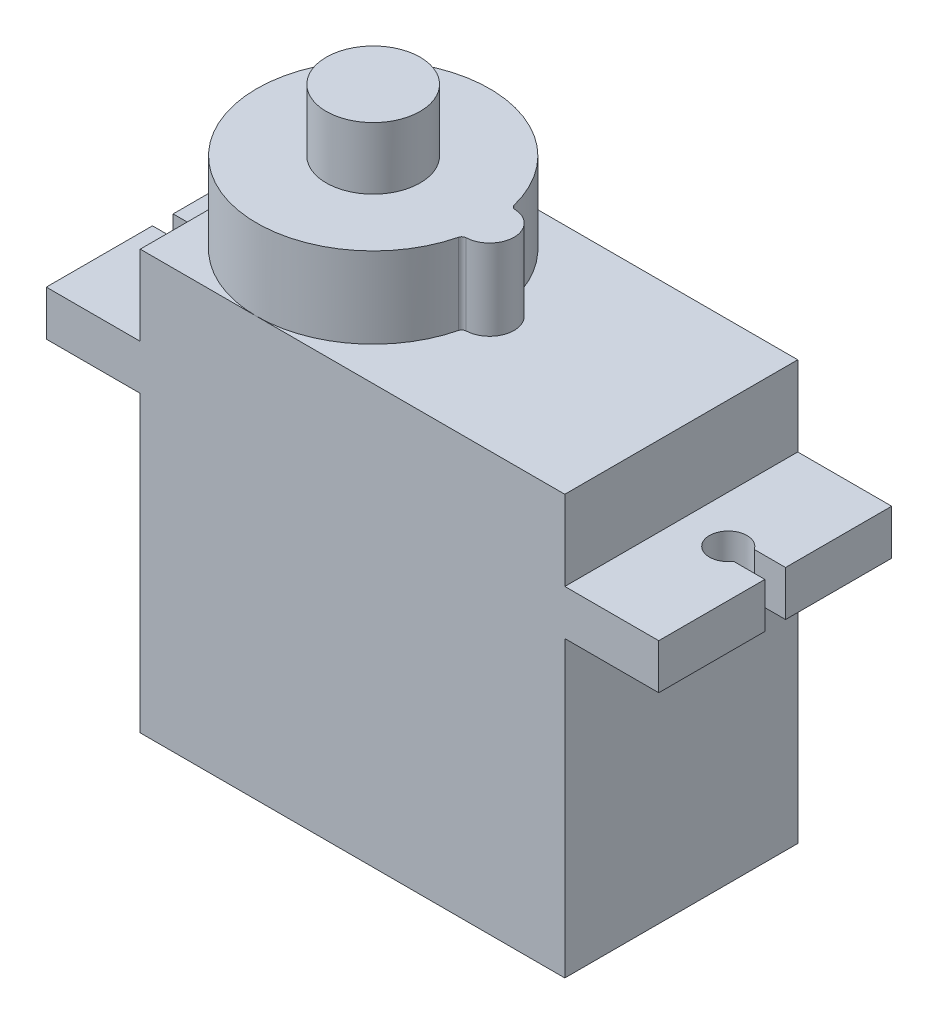
ISO-10303-21;
HEADER;
FILE_DESCRIPTION(('STEP AP214'),'2;1');
FILE_NAME('part.step','',(''),(''),'','','');
FILE_SCHEMA(('AUTOMOTIVE_DESIGN { 1 0 10303 214 1 1 1 1 }'));
ENDSEC;
DATA;
#1=APPLICATION_CONTEXT('core data for automotive mechanical design processes');
#2=APPLICATION_PROTOCOL_DEFINITION('international standard','automotive_design',2000,#1);
#3=PRODUCT_CONTEXT('',#1,'mechanical');
#4=PRODUCT('Part','Part','',(#3));
#5=PRODUCT_RELATED_PRODUCT_CATEGORY('part','',(#4));
#6=PRODUCT_DEFINITION_FORMATION('','',#4);
#7=PRODUCT_DEFINITION_CONTEXT('part definition',#1,'design');
#8=PRODUCT_DEFINITION('design','',#6,#7);
#9=PRODUCT_DEFINITION_SHAPE('','',#8);
#10=(LENGTH_UNIT() NAMED_UNIT(*) SI_UNIT(.MILLI.,.METRE.));
#11=(NAMED_UNIT(*) PLANE_ANGLE_UNIT() SI_UNIT($,.RADIAN.));
#12=(NAMED_UNIT(*) SI_UNIT($,.STERADIAN.) SOLID_ANGLE_UNIT());
#13=UNCERTAINTY_MEASURE_WITH_UNIT(LENGTH_MEASURE(1.E-05),#10,'distance_accuracy_value','');
#14=(GEOMETRIC_REPRESENTATION_CONTEXT(3) GLOBAL_UNCERTAINTY_ASSIGNED_CONTEXT((#13)) GLOBAL_UNIT_ASSIGNED_CONTEXT((#10,
#11,#12)) REPRESENTATION_CONTEXT('',''));
#15=CARTESIAN_POINT('',(0.,0.,0.));
#16=DIRECTION('',(0.,0.,1.));
#17=DIRECTION('',(1.,0.,0.));
#18=AXIS2_PLACEMENT_3D('',#15,#16,#17);
#19=CARTESIAN_POINT('',(-14.6,4.5,1.2));
#20=DIRECTION('',(1.,0.,0.));
#21=DIRECTION('',(0.,0.,-1.));
#22=AXIS2_PLACEMENT_3D('',#19,#20,#21);
#23=CYLINDRICAL_SURFACE('',#22,0.6);
#24=CARTESIAN_POINT('',(-14.6,4.5,1.2));
#25=DIRECTION('',(-1.,0.,0.));
#26=DIRECTION('',(0.,0.,1.));
#27=AXIS2_PLACEMENT_3D('',#24,#25,#26);
#28=CIRCLE('',#27,0.6);
#29=CARTESIAN_POINT('',(-14.6,4.5,1.8));
#30=VERTEX_POINT('',#29);
#31=EDGE_CURVE('E11',#30,#30,#28,.T.);
#32=ORIENTED_EDGE('',*,*,#31,.F.);
#33=EDGE_LOOP('',(#32));
#34=FACE_BOUND('',#33,.T.);
#35=CARTESIAN_POINT('',(-11.3,4.5,1.2));
#36=DIRECTION('',(-1.,0.,0.));
#37=DIRECTION('',(0.,0.,1.));
#38=AXIS2_PLACEMENT_3D('',#35,#36,#37);
#39=CIRCLE('',#38,0.6);
#40=CARTESIAN_POINT('',(-11.3,4.5,1.8));
#41=VERTEX_POINT('',#40);
#42=EDGE_CURVE('E55',#41,#41,#39,.T.);
#43=ORIENTED_EDGE('',*,*,#42,.T.);
#44=EDGE_LOOP('',(#43));
#45=FACE_BOUND('',#44,.T.);
#46=ADVANCED_FACE('F52',(#34,#45),#23,.T.);
#47=CARTESIAN_POINT('',(-14.6,0.,0.));
#48=DIRECTION('',(-1.,0.,0.));
#49=DIRECTION('',(0.,0.,1.));
#50=AXIS2_PLACEMENT_3D('',#47,#48,#49);
#51=PLANE('',#50);
#52=ORIENTED_EDGE('',*,*,#31,.T.);
#53=EDGE_LOOP('',(#52));
#54=FACE_BOUND('',#53,.T.);
#55=ADVANCED_FACE('F67',(#54),#51,.T.);
#56=CARTESIAN_POINT('',(-11.3,0.,0.));
#57=DIRECTION('',(-1.,0.,0.));
#58=DIRECTION('',(0.,0.,1.));
#59=AXIS2_PLACEMENT_3D('',#56,#57,#58);
#60=PLANE('',#59);
#61=ORIENTED_EDGE('',*,*,#42,.F.);
#62=EDGE_LOOP('',(#61));
#63=FACE_BOUND('',#62,.T.);
#64=ADVANCED_FACE('F65',(#63),#60,.F.);
#65=CLOSED_SHELL('',(#46,#55,#64));
#66=MANIFOLD_SOLID_BREP('B2',#65);
#67=CARTESIAN_POINT('',(-14.6,4.5,0.));
#68=DIRECTION('',(1.,0.,0.));
#69=DIRECTION('',(0.,0.,-1.));
#70=AXIS2_PLACEMENT_3D('',#67,#68,#69);
#71=CYLINDRICAL_SURFACE('',#70,0.6);
#72=CARTESIAN_POINT('',(-14.6,4.5,0.));
#73=DIRECTION('',(-1.,0.,0.));
#74=DIRECTION('',(0.,0.,1.));
#75=AXIS2_PLACEMENT_3D('',#72,#73,#74);
#76=CIRCLE('',#75,0.6);
#77=CARTESIAN_POINT('',(-14.6,4.5,0.600000000000002));
#78=VERTEX_POINT('',#77);
#79=EDGE_CURVE('E51',#78,#78,#76,.T.);
#80=ORIENTED_EDGE('',*,*,#79,.F.);
#81=EDGE_LOOP('',(#80));
#82=FACE_BOUND('',#81,.T.);
#83=CARTESIAN_POINT('',(-11.3,4.5,0.));
#84=DIRECTION('',(-1.,0.,0.));
#85=DIRECTION('',(0.,0.,1.));
#86=AXIS2_PLACEMENT_3D('',#83,#84,#85);
#87=CIRCLE('',#86,0.6);
#88=CARTESIAN_POINT('',(-11.3,4.5,0.600000000000001));
#89=VERTEX_POINT('',#88);
#90=EDGE_CURVE('E98',#89,#89,#87,.T.);
#91=ORIENTED_EDGE('',*,*,#90,.T.);
#92=EDGE_LOOP('',(#91));
#93=FACE_BOUND('',#92,.T.);
#94=ADVANCED_FACE('F95',(#82,#93),#71,.T.);
#95=CARTESIAN_POINT('',(-14.6,0.,0.));
#96=DIRECTION('',(-1.,0.,0.));
#97=DIRECTION('',(0.,0.,1.));
#98=AXIS2_PLACEMENT_3D('',#95,#96,#97);
#99=PLANE('',#98);
#100=ORIENTED_EDGE('',*,*,#79,.T.);
#101=EDGE_LOOP('',(#100));
#102=FACE_BOUND('',#101,.T.);
#103=ADVANCED_FACE('F110',(#102),#99,.T.);
#104=CARTESIAN_POINT('',(-11.3,0.,0.));
#105=DIRECTION('',(-1.,0.,0.));
#106=DIRECTION('',(0.,0.,1.));
#107=AXIS2_PLACEMENT_3D('',#104,#105,#106);
#108=PLANE('',#107);
#109=ORIENTED_EDGE('',*,*,#90,.F.);
#110=EDGE_LOOP('',(#109));
#111=FACE_BOUND('',#110,.T.);
#112=ADVANCED_FACE('F108',(#111),#108,.F.);
#113=CLOSED_SHELL('',(#94,#103,#112));
#114=MANIFOLD_SOLID_BREP('B6',#113);
#115=CARTESIAN_POINT('',(-14.6,4.5,-1.2));
#116=DIRECTION('',(1.,0.,0.));
#117=DIRECTION('',(0.,0.,-1.));
#118=AXIS2_PLACEMENT_3D('',#115,#116,#117);
#119=CYLINDRICAL_SURFACE('',#118,0.6);
#120=CARTESIAN_POINT('',(-14.6,4.5,-1.2));
#121=DIRECTION('',(-1.,0.,0.));
#122=DIRECTION('',(0.,0.,1.));
#123=AXIS2_PLACEMENT_3D('',#120,#121,#122);
#124=CIRCLE('',#123,0.6);
#125=CARTESIAN_POINT('',(-14.6,4.5,-0.599999999999998));
#126=VERTEX_POINT('',#125);
#127=EDGE_CURVE('E94',#126,#126,#124,.T.);
#128=ORIENTED_EDGE('',*,*,#127,.F.);
#129=EDGE_LOOP('',(#128));
#130=FACE_BOUND('',#129,.T.);
#131=CARTESIAN_POINT('',(-11.3,4.5,-1.2));
#132=DIRECTION('',(-1.,0.,0.));
#133=DIRECTION('',(0.,0.,1.));
#134=AXIS2_PLACEMENT_3D('',#131,#132,#133);
#135=CIRCLE('',#134,0.6);
#136=CARTESIAN_POINT('',(-11.3,4.5,-0.599999999999998));
#137=VERTEX_POINT('',#136);
#138=EDGE_CURVE('E172',#137,#137,#135,.T.);
#139=ORIENTED_EDGE('',*,*,#138,.T.);
#140=EDGE_LOOP('',(#139));
#141=FACE_BOUND('',#140,.T.);
#142=ADVANCED_FACE('F169',(#130,#141),#119,.T.);
#143=CARTESIAN_POINT('',(-14.6,0.,0.));
#144=DIRECTION('',(-1.,0.,0.));
#145=DIRECTION('',(0.,0.,1.));
#146=AXIS2_PLACEMENT_3D('',#143,#144,#145);
#147=PLANE('',#146);
#148=ORIENTED_EDGE('',*,*,#127,.T.);
#149=EDGE_LOOP('',(#148));
#150=FACE_BOUND('',#149,.T.);
#151=ADVANCED_FACE('F184',(#150),#147,.T.);
#152=CARTESIAN_POINT('',(-11.3,0.,0.));
#153=DIRECTION('',(-1.,0.,0.));
#154=DIRECTION('',(0.,0.,1.));
#155=AXIS2_PLACEMENT_3D('',#152,#153,#154);
#156=PLANE('',#155);
#157=ORIENTED_EDGE('',*,*,#138,.F.);
#158=EDGE_LOOP('',(#157));
#159=FACE_BOUND('',#158,.T.);
#160=ADVANCED_FACE('F182',(#159),#156,.F.);
#161=CLOSED_SHELL('',(#142,#151,#160));
#162=MANIFOLD_SOLID_BREP('B46',#161);
#163=CARTESIAN_POINT('',(0.,22.3,0.));
#164=DIRECTION('',(0.,-1.,0.));
#165=DIRECTION('',(0.,0.,-1.));
#166=AXIS2_PLACEMENT_3D('',#163,#164,#165);
#167=PLANE('',#166);
#168=CARTESIAN_POINT('',(1.16129032258064,22.3,-1.54878775058365));
#169=DIRECTION('',(0.,-1.,0.));
#170=DIRECTION('',(0.,0.,-1.));
#171=AXIS2_PLACEMENT_3D('',#168,#169,#170);
#172=CIRCLE('',#171,0.25);
#173=CARTESIAN_POINT('',(1.15140478668054,22.3,-1.29898327468306));
#174=VERTEX_POINT('',#173);
#175=CARTESIAN_POINT('',(0.918604651162789,22.3,-1.48875721761529));
#176=VERTEX_POINT('',#175);
#177=EDGE_CURVE('E249',#174,#176,#172,.T.);
#178=ORIENTED_EDGE('',*,*,#177,.F.);
#179=CARTESIAN_POINT('',(1.1,22.3,0.));
#180=DIRECTION('',(0.,1.,0.));
#181=DIRECTION('',(0.,0.,1.));
#182=AXIS2_PLACEMENT_3D('',#179,#180,#181);
#183=CIRCLE('',#182,1.3);
#184=CARTESIAN_POINT('',(1.15140478668054,22.3,1.29898327468306));
#185=VERTEX_POINT('',#184);
#186=EDGE_CURVE('E253',#185,#174,#183,.T.);
#187=ORIENTED_EDGE('',*,*,#186,.F.);
#188=CARTESIAN_POINT('',(1.16129032258064,22.3,1.54878775058365));
#189=DIRECTION('',(0.,-1.,0.));
#190=DIRECTION('',(0.,0.,1.));
#191=AXIS2_PLACEMENT_3D('',#188,#189,#190);
#192=CIRCLE('',#191,0.25);
#193=CARTESIAN_POINT('',(0.918604651162788,22.3,1.48875721761529));
#194=VERTEX_POINT('',#193);
#195=EDGE_CURVE('E589',#194,#185,#192,.T.);
#196=ORIENTED_EDGE('',*,*,#195,.F.);
#197=CARTESIAN_POINT('',(-5.1,22.3,0.));
#198=DIRECTION('',(0.,1.,0.));
#199=DIRECTION('',(0.,0.,1.));
#200=AXIS2_PLACEMENT_3D('',#197,#198,#199);
#201=CIRCLE('',#200,6.2);
#202=CARTESIAN_POINT('',(-5.1,22.3,6.2));
#203=VERTEX_POINT('',#202);
#204=EDGE_CURVE('E581',#203,#194,#201,.T.);
#205=ORIENTED_EDGE('',*,*,#204,.F.);
#206=DIRECTION('',(1.,0.,0.));
#207=VECTOR('',#206,1.);
#208=CARTESIAN_POINT('',(11.3,22.3,6.2));
#209=LINE('',#208,#207);
#210=CARTESIAN_POINT('',(11.3,22.3,6.2));
#211=VERTEX_POINT('',#210);
#212=EDGE_CURVE('E530',#203,#211,#209,.T.);
#213=ORIENTED_EDGE('',*,*,#212,.T.);
#214=DIRECTION('',(0.,0.,-1.));
#215=VECTOR('',#214,1.);
#216=CARTESIAN_POINT('',(11.3,22.3,-6.2));
#217=LINE('',#216,#215);
#218=CARTESIAN_POINT('',(11.3,22.3,-6.2));
#219=VERTEX_POINT('',#218);
#220=EDGE_CURVE('E535',#211,#219,#217,.T.);
#221=ORIENTED_EDGE('',*,*,#220,.T.);
#222=DIRECTION('',(-1.,0.,0.));
#223=VECTOR('',#222,1.);
#224=CARTESIAN_POINT('',(11.3,22.3,-6.2));
#225=LINE('',#224,#223);
#226=CARTESIAN_POINT('',(-5.1,22.3,-6.2));
#227=VERTEX_POINT('',#226);
#228=EDGE_CURVE('E538',#219,#227,#225,.T.);
#229=ORIENTED_EDGE('',*,*,#228,.T.);
#230=EDGE_CURVE('E585',#176,#227,#201,.T.);
#231=ORIENTED_EDGE('',*,*,#230,.F.);
#232=EDGE_LOOP('',(#178,#187,#196,#205,#213,#221,#229,#231));
#233=FACE_BOUND('',#232,.T.);
#234=ADVANCED_FACE('F234',(#233),#167,.F.);
#235=CARTESIAN_POINT('',(-11.3,22.3,0.));
#236=VERTEX_POINT('',#235);
#237=EDGE_CURVE('E242',#227,#236,#201,.T.);
#238=ORIENTED_EDGE('',*,*,#237,.F.);
#239=CARTESIAN_POINT('',(-11.3,22.3,-6.2));
#240=VERTEX_POINT('',#239);
#241=EDGE_CURVE('E537',#227,#240,#225,.T.);
#242=ORIENTED_EDGE('',*,*,#241,.T.);
#243=DIRECTION('',(0.,0.,1.));
#244=VECTOR('',#243,1.);
#245=CARTESIAN_POINT('',(-11.3,22.3,-6.2));
#246=LINE('',#245,#244);
#247=EDGE_CURVE('E527',#240,#236,#246,.T.);
#248=ORIENTED_EDGE('',*,*,#247,.T.);
#249=EDGE_LOOP('',(#238,#242,#248));
#250=FACE_BOUND('',#249,.T.);
#251=ADVANCED_FACE('F594',(#250),#167,.F.);
#252=CARTESIAN_POINT('',(-11.3,18.05,-6.2));
#253=DIRECTION('',(0.,1.,0.));
#254=DIRECTION('',(0.,0.,1.));
#255=AXIS2_PLACEMENT_3D('',#252,#253,#254);
#256=PLANE('',#255);
#257=CARTESIAN_POINT('',(-13.8,18.05,0.));
#258=DIRECTION('',(0.,-1.,0.));
#259=DIRECTION('',(0.,0.,1.));
#260=AXIS2_PLACEMENT_3D('',#257,#258,#259);
#261=CIRCLE('',#260,1.);
#262=CARTESIAN_POINT('',(-14.6351646544245,18.05,-0.55));
#263=VERTEX_POINT('',#262);
#264=CARTESIAN_POINT('',(-14.6351646544245,18.05,0.55));
#265=VERTEX_POINT('',#264);
#266=EDGE_CURVE('E425',#263,#265,#261,.T.);
#267=ORIENTED_EDGE('',*,*,#266,.T.);
#268=DIRECTION('',(-1.,0.,0.));
#269=VECTOR('',#268,1.);
#270=CARTESIAN_POINT('',(-16.3,18.05,0.55));
#271=LINE('',#270,#269);
#272=CARTESIAN_POINT('',(-16.3,18.05,0.55));
#273=VERTEX_POINT('',#272);
#274=EDGE_CURVE('E436',#265,#273,#271,.T.);
#275=ORIENTED_EDGE('',*,*,#274,.T.);
#276=DIRECTION('',(0.,0.,1.));
#277=VECTOR('',#276,1.);
#278=CARTESIAN_POINT('',(-16.3,18.05,-6.2));
#279=LINE('',#278,#277);
#280=CARTESIAN_POINT('',(-16.3,18.05,6.2));
#281=VERTEX_POINT('',#280);
#282=EDGE_CURVE('E476',#273,#281,#279,.T.);
#283=ORIENTED_EDGE('',*,*,#282,.T.);
#284=DIRECTION('',(-1.,0.,0.));
#285=VECTOR('',#284,1.);
#286=CARTESIAN_POINT('',(-11.3,18.05,6.2));
#287=LINE('',#286,#285);
#288=CARTESIAN_POINT('',(-11.3,18.05,6.2));
#289=VERTEX_POINT('',#288);
#290=EDGE_CURVE('E460',#289,#281,#287,.T.);
#291=ORIENTED_EDGE('',*,*,#290,.F.);
#292=DIRECTION('',(0.,0.,1.));
#293=VECTOR('',#292,1.);
#294=CARTESIAN_POINT('',(-11.3,18.05,-6.2));
#295=LINE('',#294,#293);
#296=CARTESIAN_POINT('',(-11.3,18.05,-6.2));
#297=VERTEX_POINT('',#296);
#298=EDGE_CURVE('E484',#297,#289,#295,.T.);
#299=ORIENTED_EDGE('',*,*,#298,.F.);
#300=DIRECTION('',(-1.,0.,0.));
#301=VECTOR('',#300,1.);
#302=CARTESIAN_POINT('',(-11.3,18.05,-6.2));
#303=LINE('',#302,#301);
#304=CARTESIAN_POINT('',(-16.3,18.05,-6.2));
#305=VERTEX_POINT('',#304);
#306=EDGE_CURVE('E467',#297,#305,#303,.T.);
#307=ORIENTED_EDGE('',*,*,#306,.T.);
#308=CARTESIAN_POINT('',(-16.3,18.05,-0.55));
#309=VERTEX_POINT('',#308);
#310=EDGE_CURVE('E494',#305,#309,#279,.T.);
#311=ORIENTED_EDGE('',*,*,#310,.T.);
#312=DIRECTION('',(1.,0.,0.));
#313=VECTOR('',#312,1.);
#314=CARTESIAN_POINT('',(-14.6351646544245,18.05,-0.55));
#315=LINE('',#314,#313);
#316=EDGE_CURVE('E428',#309,#263,#315,.T.);
#317=ORIENTED_EDGE('',*,*,#316,.T.);
#318=EDGE_LOOP('',(#267,#275,#283,#291,#299,#307,#311,#317));
#319=FACE_BOUND('',#318,.T.);
#320=ADVANCED_FACE('F662',(#319),#256,.T.);
#321=CARTESIAN_POINT('',(-11.3,15.65,-6.2));
#322=DIRECTION('',(0.,-1.,0.));
#323=DIRECTION('',(0.,0.,-1.));
#324=AXIS2_PLACEMENT_3D('',#321,#322,#323);
#325=PLANE('',#324);
#326=DIRECTION('',(0.,0.,1.));
#327=VECTOR('',#326,1.);
#328=CARTESIAN_POINT('',(-16.3,15.65,-6.2));
#329=LINE('',#328,#327);
#330=CARTESIAN_POINT('',(-16.3,15.65,0.55));
#331=VERTEX_POINT('',#330);
#332=CARTESIAN_POINT('',(-16.3,15.65,6.2));
#333=VERTEX_POINT('',#332);
#334=EDGE_CURVE('E493',#331,#333,#329,.T.);
#335=ORIENTED_EDGE('',*,*,#334,.F.);
#336=DIRECTION('',(1.,0.,0.));
#337=VECTOR('',#336,1.);
#338=CARTESIAN_POINT('',(-11.3,15.65,0.550000000000001));
#339=LINE('',#338,#337);
#340=CARTESIAN_POINT('',(-14.6351646544245,15.65,0.55));
#341=VERTEX_POINT('',#340);
#342=EDGE_CURVE('E446',#331,#341,#339,.T.);
#343=ORIENTED_EDGE('',*,*,#342,.T.);
#344=CARTESIAN_POINT('',(-13.8,15.65,0.));
#345=DIRECTION('',(0.,-1.,0.));
#346=DIRECTION('',(0.,0.,-1.));
#347=AXIS2_PLACEMENT_3D('',#344,#345,#346);
#348=CIRCLE('',#347,1.);
#349=CARTESIAN_POINT('',(-14.6351646544245,15.65,-0.55));
#350=VERTEX_POINT('',#349);
#351=EDGE_CURVE('E579',#341,#350,#348,.F.);
#352=ORIENTED_EDGE('',*,*,#351,.T.);
#353=DIRECTION('',(-1.,0.,0.));
#354=VECTOR('',#353,1.);
#355=CARTESIAN_POINT('',(-11.3,15.65,-0.55));
#356=LINE('',#355,#354);
#357=CARTESIAN_POINT('',(-16.3,15.65,-0.55));
#358=VERTEX_POINT('',#357);
#359=EDGE_CURVE('E442',#350,#358,#356,.T.);
#360=ORIENTED_EDGE('',*,*,#359,.T.);
#361=CARTESIAN_POINT('',(-16.3,15.65,-6.2));
#362=VERTEX_POINT('',#361);
#363=EDGE_CURVE('E490',#362,#358,#329,.T.);
#364=ORIENTED_EDGE('',*,*,#363,.F.);
#365=DIRECTION('',(1.,0.,0.));
#366=VECTOR('',#365,1.);
#367=CARTESIAN_POINT('',(-11.3,15.65,-6.2));
#368=LINE('',#367,#366);
#369=CARTESIAN_POINT('',(-11.3,15.65,-6.2));
#370=VERTEX_POINT('',#369);
#371=EDGE_CURVE('E474',#362,#370,#368,.T.);
#372=ORIENTED_EDGE('',*,*,#371,.T.);
#373=DIRECTION('',(0.,0.,1.));
#374=VECTOR('',#373,1.);
#375=CARTESIAN_POINT('',(-11.3,15.65,-6.2));
#376=LINE('',#375,#374);
#377=CARTESIAN_POINT('',(-11.3,15.65,6.2));
#378=VERTEX_POINT('',#377);
#379=EDGE_CURVE('E488',#370,#378,#376,.T.);
#380=ORIENTED_EDGE('',*,*,#379,.T.);
#381=DIRECTION('',(1.,0.,0.));
#382=VECTOR('',#381,1.);
#383=CARTESIAN_POINT('',(-11.3,15.65,6.2));
#384=LINE('',#383,#382);
#385=EDGE_CURVE('E471',#333,#378,#384,.T.);
#386=ORIENTED_EDGE('',*,*,#385,.F.);
#387=EDGE_LOOP('',(#335,#343,#352,#360,#364,#372,#380,#386));
#388=FACE_BOUND('',#387,.T.);
#389=ADVANCED_FACE('F642',(#388),#325,.T.);
#390=CARTESIAN_POINT('',(-16.3,18.05,-6.2));
#391=DIRECTION('',(-1.,0.,0.));
#392=DIRECTION('',(0.,-1.,0.));
#393=AXIS2_PLACEMENT_3D('',#390,#391,#392);
#394=PLANE('',#393);
#395=ORIENTED_EDGE('',*,*,#282,.F.);
#396=DIRECTION('',(0.,-1.,0.));
#397=VECTOR('',#396,1.);
#398=CARTESIAN_POINT('',(-16.3,18.05,0.55));
#399=LINE('',#398,#397);
#400=EDGE_CURVE('E577',#273,#331,#399,.T.);
#401=ORIENTED_EDGE('',*,*,#400,.T.);
#402=ORIENTED_EDGE('',*,*,#334,.T.);
#403=DIRECTION('',(0.,-1.,0.));
#404=VECTOR('',#403,1.);
#405=CARTESIAN_POINT('',(-16.3,18.05,6.2));
#406=LINE('',#405,#404);
#407=EDGE_CURVE('E479',#281,#333,#406,.T.);
#408=ORIENTED_EDGE('',*,*,#407,.F.);
#409=EDGE_LOOP('',(#395,#401,#402,#408));
#410=FACE_BOUND('',#409,.T.);
#411=ADVANCED_FACE('F648',(#410),#394,.T.);
#412=ORIENTED_EDGE('',*,*,#363,.T.);
#413=DIRECTION('',(0.,1.,0.));
#414=VECTOR('',#413,1.);
#415=CARTESIAN_POINT('',(-16.3,18.05,-0.55));
#416=LINE('',#415,#414);
#417=EDGE_CURVE('E574',#358,#309,#416,.T.);
#418=ORIENTED_EDGE('',*,*,#417,.T.);
#419=ORIENTED_EDGE('',*,*,#310,.F.);
#420=DIRECTION('',(0.,-1.,0.));
#421=VECTOR('',#420,1.);
#422=CARTESIAN_POINT('',(-16.3,18.05,-6.2));
#423=LINE('',#422,#421);
#424=EDGE_CURVE('E470',#305,#362,#423,.T.);
#425=ORIENTED_EDGE('',*,*,#424,.T.);
#426=EDGE_LOOP('',(#412,#418,#419,#425));
#427=FACE_BOUND('',#426,.T.);
#428=ADVANCED_FACE('F660',(#427),#394,.T.);
#429=CARTESIAN_POINT('',(16.3,18.05,-6.2));
#430=DIRECTION('',(1.,0.,0.));
#431=DIRECTION('',(0.,1.,0.));
#432=AXIS2_PLACEMENT_3D('',#429,#430,#431);
#433=PLANE('',#432);
#434=DIRECTION('',(0.,1.,0.));
#435=VECTOR('',#434,1.);
#436=CARTESIAN_POINT('',(16.3,-4.25,-0.55));
#437=LINE('',#436,#435);
#438=CARTESIAN_POINT('',(16.3,15.65,-0.55));
#439=VERTEX_POINT('',#438);
#440=CARTESIAN_POINT('',(16.3,18.05,-0.55));
#441=VERTEX_POINT('',#440);
#442=EDGE_CURVE('E461',#439,#441,#437,.T.);
#443=ORIENTED_EDGE('',*,*,#442,.F.);
#444=DIRECTION('',(0.,0.,1.));
#445=VECTOR('',#444,1.);
#446=CARTESIAN_POINT('',(16.3,15.65,-6.2));
#447=LINE('',#446,#445);
#448=CARTESIAN_POINT('',(16.3,15.65,-6.2));
#449=VERTEX_POINT('',#448);
#450=EDGE_CURVE('E521',#449,#439,#447,.T.);
#451=ORIENTED_EDGE('',*,*,#450,.F.);
#452=DIRECTION('',(0.,1.,0.));
#453=VECTOR('',#452,1.);
#454=CARTESIAN_POINT('',(16.3,18.05,-6.2));
#455=LINE('',#454,#453);
#456=CARTESIAN_POINT('',(16.3,18.05,-6.2));
#457=VERTEX_POINT('',#456);
#458=EDGE_CURVE('E500',#449,#457,#455,.T.);
#459=ORIENTED_EDGE('',*,*,#458,.T.);
#460=DIRECTION('',(0.,0.,1.));
#461=VECTOR('',#460,1.);
#462=CARTESIAN_POINT('',(16.3,18.05,-6.2));
#463=LINE('',#462,#461);
#464=EDGE_CURVE('E517',#457,#441,#463,.T.);
#465=ORIENTED_EDGE('',*,*,#464,.T.);
#466=EDGE_LOOP('',(#443,#451,#459,#465));
#467=FACE_BOUND('',#466,.T.);
#468=ADVANCED_FACE('F618',(#467),#433,.T.);
#469=CARTESIAN_POINT('',(-11.3,22.3,-6.2));
#470=DIRECTION('',(1.,0.,0.));
#471=DIRECTION('',(0.,0.,-1.));
#472=AXIS2_PLACEMENT_3D('',#469,#470,#471);
#473=PLANE('',#472);
#474=ORIENTED_EDGE('',*,*,#379,.F.);
#475=DIRECTION('',(0.,-1.,0.));
#476=VECTOR('',#475,1.);
#477=CARTESIAN_POINT('',(-11.3,22.3,-6.2));
#478=LINE('',#477,#476);
#479=CARTESIAN_POINT('',(-11.3,0.,-6.2));
#480=VERTEX_POINT('',#479);
#481=EDGE_CURVE('E541',#370,#480,#478,.T.);
#482=ORIENTED_EDGE('',*,*,#481,.T.);
#483=DIRECTION('',(0.,0.,1.));
#484=VECTOR('',#483,1.);
#485=CARTESIAN_POINT('',(-11.3,0.,-6.2));
#486=LINE('',#485,#484);
#487=CARTESIAN_POINT('',(-11.3,0.,6.2));
#488=VERTEX_POINT('',#487);
#489=EDGE_CURVE('E516',#480,#488,#486,.T.);
#490=ORIENTED_EDGE('',*,*,#489,.T.);
#491=DIRECTION('',(0.,-1.,0.));
#492=VECTOR('',#491,1.);
#493=CARTESIAN_POINT('',(-11.3,22.3,6.2));
#494=LINE('',#493,#492);
#495=EDGE_CURVE('E564',#378,#488,#494,.T.);
#496=ORIENTED_EDGE('',*,*,#495,.F.);
#497=EDGE_LOOP('',(#474,#482,#490,#496));
#498=FACE_BOUND('',#497,.T.);
#499=ADVANCED_FACE('F638',(#498),#473,.F.);
#500=CARTESIAN_POINT('',(11.3,22.3,-6.2));
#501=DIRECTION('',(-1.,0.,0.));
#502=DIRECTION('',(0.,0.,1.));
#503=AXIS2_PLACEMENT_3D('',#500,#501,#502);
#504=PLANE('',#503);
#505=DIRECTION('',(0.,0.,1.));
#506=VECTOR('',#505,1.);
#507=CARTESIAN_POINT('',(11.3,18.05,-6.2));
#508=LINE('',#507,#506);
#509=CARTESIAN_POINT('',(11.3,18.05,-6.2));
#510=VERTEX_POINT('',#509);
#511=CARTESIAN_POINT('',(11.3,18.05,6.2));
#512=VERTEX_POINT('',#511);
#513=EDGE_CURVE('E514',#510,#512,#508,.T.);
#514=ORIENTED_EDGE('',*,*,#513,.F.);
#515=DIRECTION('',(0.,-1.,0.));
#516=VECTOR('',#515,1.);
#517=CARTESIAN_POINT('',(11.3,22.3,-6.2));
#518=LINE('',#517,#516);
#519=EDGE_CURVE('E557',#219,#510,#518,.T.);
#520=ORIENTED_EDGE('',*,*,#519,.F.);
#521=ORIENTED_EDGE('',*,*,#220,.F.);
#522=DIRECTION('',(0.,-1.,0.));
#523=VECTOR('',#522,1.);
#524=CARTESIAN_POINT('',(11.3,22.3,6.2));
#525=LINE('',#524,#523);
#526=EDGE_CURVE('E561',#211,#512,#525,.T.);
#527=ORIENTED_EDGE('',*,*,#526,.T.);
#528=EDGE_LOOP('',(#514,#520,#521,#527));
#529=FACE_BOUND('',#528,.T.);
#530=ADVANCED_FACE('F607',(#529),#504,.F.);
#531=EDGE_CURVE('E553',#240,#297,#478,.T.);
#532=ORIENTED_EDGE('',*,*,#531,.T.);
#533=ORIENTED_EDGE('',*,*,#298,.T.);
#534=CARTESIAN_POINT('',(-11.3,22.3,6.2));
#535=VERTEX_POINT('',#534);
#536=EDGE_CURVE('E565',#535,#289,#494,.T.);
#537=ORIENTED_EDGE('',*,*,#536,.F.);
#538=EDGE_CURVE('E531',#236,#535,#246,.T.);
#539=ORIENTED_EDGE('',*,*,#538,.F.);
#540=ORIENTED_EDGE('',*,*,#247,.F.);
#541=EDGE_LOOP('',(#532,#533,#537,#539,#540));
#542=FACE_BOUND('',#541,.T.);
#543=ADVANCED_FACE('F236',(#542),#473,.F.);
#544=CARTESIAN_POINT('',(11.3,22.3,6.2));
#545=DIRECTION('',(0.,0.,-1.));
#546=DIRECTION('',(-1.,0.,0.));
#547=AXIS2_PLACEMENT_3D('',#544,#545,#546);
#548=PLANE('',#547);
#549=DIRECTION('',(1.,0.,0.));
#550=VECTOR('',#549,1.);
#551=CARTESIAN_POINT('',(11.3,0.,6.2));
#552=LINE('',#551,#550);
#553=CARTESIAN_POINT('',(11.3,0.,6.2));
#554=VERTEX_POINT('',#553);
#555=EDGE_CURVE('E544',#488,#554,#552,.T.);
#556=ORIENTED_EDGE('',*,*,#555,.T.);
#557=CARTESIAN_POINT('',(11.3,15.65,6.2));
#558=VERTEX_POINT('',#557);
#559=EDGE_CURVE('E560',#558,#554,#525,.T.);
#560=ORIENTED_EDGE('',*,*,#559,.F.);
#561=DIRECTION('',(1.,0.,0.));
#562=VECTOR('',#561,1.);
#563=CARTESIAN_POINT('',(11.3,15.65,6.2));
#564=LINE('',#563,#562);
#565=CARTESIAN_POINT('',(16.3,15.65,6.2));
#566=VERTEX_POINT('',#565);
#567=EDGE_CURVE('E487',#558,#566,#564,.T.);
#568=ORIENTED_EDGE('',*,*,#567,.T.);
#569=DIRECTION('',(0.,1.,0.));
#570=VECTOR('',#569,1.);
#571=CARTESIAN_POINT('',(16.3,18.05,6.2));
#572=LINE('',#571,#570);
#573=CARTESIAN_POINT('',(16.3,18.05,6.2));
#574=VERTEX_POINT('',#573);
#575=EDGE_CURVE('E509',#566,#574,#572,.T.);
#576=ORIENTED_EDGE('',*,*,#575,.T.);
#577=DIRECTION('',(-1.,0.,0.));
#578=VECTOR('',#577,1.);
#579=CARTESIAN_POINT('',(11.3,18.05,6.2));
#580=LINE('',#579,#578);
#581=EDGE_CURVE('E501',#574,#512,#580,.T.);
#582=ORIENTED_EDGE('',*,*,#581,.T.);
#583=ORIENTED_EDGE('',*,*,#526,.F.);
#584=ORIENTED_EDGE('',*,*,#212,.F.);
#585=EDGE_CURVE('E532',#535,#203,#209,.T.);
#586=ORIENTED_EDGE('',*,*,#585,.F.);
#587=ORIENTED_EDGE('',*,*,#536,.T.);
#588=ORIENTED_EDGE('',*,*,#290,.T.);
#589=ORIENTED_EDGE('',*,*,#407,.T.);
#590=ORIENTED_EDGE('',*,*,#385,.T.);
#591=ORIENTED_EDGE('',*,*,#495,.T.);
#592=EDGE_LOOP('',(#556,#560,#568,#576,#582,#583,#584,#586,#587,#588,#589,#590,#591));
#593=FACE_BOUND('',#592,.T.);
#594=ADVANCED_FACE('F644',(#593),#548,.F.);
#595=CARTESIAN_POINT('',(11.3,15.65,-6.2));
#596=VERTEX_POINT('',#595);
#597=CARTESIAN_POINT('',(11.3,0.,-6.2));
#598=VERTEX_POINT('',#597);
#599=EDGE_CURVE('E556',#596,#598,#518,.T.);
#600=ORIENTED_EDGE('',*,*,#599,.F.);
#601=DIRECTION('',(0.,0.,1.));
#602=VECTOR('',#601,1.);
#603=CARTESIAN_POINT('',(11.3,15.65,-6.2));
#604=LINE('',#603,#602);
#605=EDGE_CURVE('E506',#596,#558,#604,.T.);
#606=ORIENTED_EDGE('',*,*,#605,.T.);
#607=ORIENTED_EDGE('',*,*,#559,.T.);
#608=DIRECTION('',(0.,0.,-1.));
#609=VECTOR('',#608,1.);
#610=CARTESIAN_POINT('',(11.3,0.,-6.2));
#611=LINE('',#610,#609);
#612=EDGE_CURVE('E547',#554,#598,#611,.T.);
#613=ORIENTED_EDGE('',*,*,#612,.T.);
#614=EDGE_LOOP('',(#600,#606,#607,#613));
#615=FACE_BOUND('',#614,.T.);
#616=ADVANCED_FACE('F625',(#615),#504,.F.);
#617=CARTESIAN_POINT('',(11.3,22.3,-6.2));
#618=DIRECTION('',(0.,0.,1.));
#619=DIRECTION('',(1.,0.,0.));
#620=AXIS2_PLACEMENT_3D('',#617,#618,#619);
#621=PLANE('',#620);
#622=DIRECTION('',(-1.,0.,0.));
#623=VECTOR('',#622,1.);
#624=CARTESIAN_POINT('',(11.3,0.,-6.2));
#625=LINE('',#624,#623);
#626=EDGE_CURVE('E550',#598,#480,#625,.T.);
#627=ORIENTED_EDGE('',*,*,#626,.T.);
#628=ORIENTED_EDGE('',*,*,#481,.F.);
#629=ORIENTED_EDGE('',*,*,#371,.F.);
#630=ORIENTED_EDGE('',*,*,#424,.F.);
#631=ORIENTED_EDGE('',*,*,#306,.F.);
#632=ORIENTED_EDGE('',*,*,#531,.F.);
#633=ORIENTED_EDGE('',*,*,#241,.F.);
#634=ORIENTED_EDGE('',*,*,#228,.F.);
#635=ORIENTED_EDGE('',*,*,#519,.T.);
#636=DIRECTION('',(-1.,0.,0.));
#637=VECTOR('',#636,1.);
#638=CARTESIAN_POINT('',(11.3,18.05,-6.2));
#639=LINE('',#638,#637);
#640=EDGE_CURVE('E504',#457,#510,#639,.T.);
#641=ORIENTED_EDGE('',*,*,#640,.F.);
#642=ORIENTED_EDGE('',*,*,#458,.F.);
#643=DIRECTION('',(1.,0.,0.));
#644=VECTOR('',#643,1.);
#645=CARTESIAN_POINT('',(11.3,15.65,-6.2));
#646=LINE('',#645,#644);
#647=EDGE_CURVE('E497',#596,#449,#646,.T.);
#648=ORIENTED_EDGE('',*,*,#647,.F.);
#649=ORIENTED_EDGE('',*,*,#599,.T.);
#650=EDGE_LOOP('',(#627,#628,#629,#630,#631,#632,#633,#634,#635,#641,#642,#648,#649));
#651=FACE_BOUND('',#650,.T.);
#652=ADVANCED_FACE('F599',(#651),#621,.F.);
#653=EDGE_CURVE('E583',#236,#203,#201,.T.);
#654=ORIENTED_EDGE('',*,*,#653,.F.);
#655=ORIENTED_EDGE('',*,*,#538,.T.);
#656=ORIENTED_EDGE('',*,*,#585,.T.);
#657=EDGE_LOOP('',(#654,#655,#656));
#658=FACE_BOUND('',#657,.T.);
#659=ADVANCED_FACE('F668',(#658),#167,.F.);
#660=CARTESIAN_POINT('',(0.,0.,0.));
#661=DIRECTION('',(0.,-1.,0.));
#662=DIRECTION('',(0.,0.,-1.));
#663=AXIS2_PLACEMENT_3D('',#660,#661,#662);
#664=PLANE('',#663);
#665=ORIENTED_EDGE('',*,*,#489,.F.);
#666=ORIENTED_EDGE('',*,*,#626,.F.);
#667=ORIENTED_EDGE('',*,*,#612,.F.);
#668=ORIENTED_EDGE('',*,*,#555,.F.);
#669=EDGE_LOOP('',(#665,#666,#667,#668));
#670=FACE_BOUND('',#669,.T.);
#671=ADVANCED_FACE('F632',(#670),#664,.T.);
#672=CARTESIAN_POINT('',(11.3,18.05,-6.2));
#673=DIRECTION('',(0.,1.,0.));
#674=DIRECTION('',(0.,0.,1.));
#675=AXIS2_PLACEMENT_3D('',#672,#673,#674);
#676=PLANE('',#675);
#677=DIRECTION('',(-1.,0.,0.));
#678=VECTOR('',#677,1.);
#679=CARTESIAN_POINT('',(14.6351646544245,18.05,-0.55));
#680=LINE('',#679,#678);
#681=CARTESIAN_POINT('',(14.6351646544245,18.05,-0.55));
#682=VERTEX_POINT('',#681);
#683=EDGE_CURVE('E454',#441,#682,#680,.T.);
#684=ORIENTED_EDGE('',*,*,#683,.F.);
#685=ORIENTED_EDGE('',*,*,#464,.F.);
#686=ORIENTED_EDGE('',*,*,#640,.T.);
#687=ORIENTED_EDGE('',*,*,#513,.T.);
#688=ORIENTED_EDGE('',*,*,#581,.F.);
#689=CARTESIAN_POINT('',(16.3,18.05,0.55));
#690=VERTEX_POINT('',#689);
#691=EDGE_CURVE('E520',#690,#574,#463,.T.);
#692=ORIENTED_EDGE('',*,*,#691,.F.);
#693=DIRECTION('',(1.,0.,0.));
#694=VECTOR('',#693,1.);
#695=CARTESIAN_POINT('',(16.3,18.05,0.55));
#696=LINE('',#695,#694);
#697=CARTESIAN_POINT('',(14.6351646544245,18.05,0.55));
#698=VERTEX_POINT('',#697);
#699=EDGE_CURVE('E452',#698,#690,#696,.T.);
#700=ORIENTED_EDGE('',*,*,#699,.F.);
#701=CARTESIAN_POINT('',(13.8,18.05,0.));
#702=DIRECTION('',(0.,1.,0.));
#703=DIRECTION('',(0.,0.,1.));
#704=AXIS2_PLACEMENT_3D('',#701,#702,#703);
#705=CIRCLE('',#704,1.);
#706=EDGE_CURVE('E449',#682,#698,#705,.T.);
#707=ORIENTED_EDGE('',*,*,#706,.F.);
#708=EDGE_LOOP('',(#684,#685,#686,#687,#688,#692,#700,#707));
#709=FACE_BOUND('',#708,.T.);
#710=ADVANCED_FACE('F613',(#709),#676,.T.);
#711=DIRECTION('',(0.,1.,0.));
#712=VECTOR('',#711,1.);
#713=CARTESIAN_POINT('',(16.3,-4.25,0.55));
#714=LINE('',#713,#712);
#715=CARTESIAN_POINT('',(16.3,15.65,0.55));
#716=VERTEX_POINT('',#715);
#717=EDGE_CURVE('E463',#716,#690,#714,.T.);
#718=ORIENTED_EDGE('',*,*,#717,.T.);
#719=ORIENTED_EDGE('',*,*,#691,.T.);
#720=ORIENTED_EDGE('',*,*,#575,.F.);
#721=EDGE_CURVE('E524',#716,#566,#447,.T.);
#722=ORIENTED_EDGE('',*,*,#721,.F.);
#723=EDGE_LOOP('',(#718,#719,#720,#722));
#724=FACE_BOUND('',#723,.T.);
#725=ADVANCED_FACE('F695',(#724),#433,.T.);
#726=CARTESIAN_POINT('',(11.3,15.65,-6.2));
#727=DIRECTION('',(0.,-1.,0.));
#728=DIRECTION('',(0.,0.,-1.));
#729=AXIS2_PLACEMENT_3D('',#726,#727,#728);
#730=PLANE('',#729);
#731=DIRECTION('',(1.,0.,0.));
#732=VECTOR('',#731,1.);
#733=CARTESIAN_POINT('',(11.3,15.65,-0.55));
#734=LINE('',#733,#732);
#735=CARTESIAN_POINT('',(14.6351646544245,15.65,-0.55));
#736=VERTEX_POINT('',#735);
#737=EDGE_CURVE('E572',#736,#439,#734,.T.);
#738=ORIENTED_EDGE('',*,*,#737,.F.);
#739=CARTESIAN_POINT('',(13.8,15.65,0.));
#740=DIRECTION('',(0.,-1.,0.));
#741=DIRECTION('',(0.,0.,-1.));
#742=AXIS2_PLACEMENT_3D('',#739,#740,#741);
#743=CIRCLE('',#742,1.);
#744=CARTESIAN_POINT('',(14.6351646544245,15.65,0.55));
#745=VERTEX_POINT('',#744);
#746=EDGE_CURVE('E570',#745,#736,#743,.T.);
#747=ORIENTED_EDGE('',*,*,#746,.F.);
#748=DIRECTION('',(-1.,0.,0.));
#749=VECTOR('',#748,1.);
#750=CARTESIAN_POINT('',(11.3,15.65,0.550000000000001));
#751=LINE('',#750,#749);
#752=EDGE_CURVE('E568',#716,#745,#751,.T.);
#753=ORIENTED_EDGE('',*,*,#752,.F.);
#754=ORIENTED_EDGE('',*,*,#721,.T.);
#755=ORIENTED_EDGE('',*,*,#567,.F.);
#756=ORIENTED_EDGE('',*,*,#605,.F.);
#757=ORIENTED_EDGE('',*,*,#647,.T.);
#758=ORIENTED_EDGE('',*,*,#450,.T.);
#759=EDGE_LOOP('',(#738,#747,#753,#754,#755,#756,#757,#758));
#760=FACE_BOUND('',#759,.T.);
#761=ADVANCED_FACE('F621',(#760),#730,.T.);
#762=CARTESIAN_POINT('',(13.8,-4.25,0.));
#763=DIRECTION('',(0.,1.,0.));
#764=DIRECTION('',(0.,0.,1.));
#765=AXIS2_PLACEMENT_3D('',#762,#763,#764);
#766=CYLINDRICAL_SURFACE('',#765,1.);
#767=ORIENTED_EDGE('',*,*,#746,.T.);
#768=DIRECTION('',(0.,1.,0.));
#769=VECTOR('',#768,1.);
#770=CARTESIAN_POINT('',(14.6351646544245,-4.25,-0.55));
#771=LINE('',#770,#769);
#772=EDGE_CURVE('E458',#736,#682,#771,.T.);
#773=ORIENTED_EDGE('',*,*,#772,.T.);
#774=ORIENTED_EDGE('',*,*,#706,.T.);
#775=DIRECTION('',(0.,1.,0.));
#776=VECTOR('',#775,1.);
#777=CARTESIAN_POINT('',(14.6351646544245,-4.25,0.55));
#778=LINE('',#777,#776);
#779=EDGE_CURVE('E457',#745,#698,#778,.T.);
#780=ORIENTED_EDGE('',*,*,#779,.F.);
#781=EDGE_LOOP('',(#767,#773,#774,#780));
#782=FACE_BOUND('',#781,.T.);
#783=ADVANCED_FACE('F699',(#782),#766,.F.);
#784=CARTESIAN_POINT('',(14.6351646544245,-4.25,-0.55));
#785=DIRECTION('',(0.,0.,-1.));
#786=DIRECTION('',(-1.,0.,0.));
#787=AXIS2_PLACEMENT_3D('',#784,#785,#786);
#788=PLANE('',#787);
#789=ORIENTED_EDGE('',*,*,#737,.T.);
#790=ORIENTED_EDGE('',*,*,#442,.T.);
#791=ORIENTED_EDGE('',*,*,#683,.T.);
#792=ORIENTED_EDGE('',*,*,#772,.F.);
#793=EDGE_LOOP('',(#789,#790,#791,#792));
#794=FACE_BOUND('',#793,.T.);
#795=ADVANCED_FACE('F703',(#794),#788,.F.);
#796=CARTESIAN_POINT('',(16.3,-4.25,0.55));
#797=DIRECTION('',(0.,0.,1.));
#798=DIRECTION('',(1.,0.,0.));
#799=AXIS2_PLACEMENT_3D('',#796,#797,#798);
#800=PLANE('',#799);
#801=ORIENTED_EDGE('',*,*,#752,.T.);
#802=ORIENTED_EDGE('',*,*,#779,.T.);
#803=ORIENTED_EDGE('',*,*,#699,.T.);
#804=ORIENTED_EDGE('',*,*,#717,.F.);
#805=EDGE_LOOP('',(#801,#802,#803,#804));
#806=FACE_BOUND('',#805,.T.);
#807=ADVANCED_FACE('F709',(#806),#800,.F.);
#808=CARTESIAN_POINT('',(-13.8,-4.25,0.));
#809=DIRECTION('',(0.,1.,0.));
#810=DIRECTION('',(0.,0.,1.));
#811=AXIS2_PLACEMENT_3D('',#808,#809,#810);
#812=CYLINDRICAL_SURFACE('',#811,1.);
#813=DIRECTION('',(0.,1.,0.));
#814=VECTOR('',#813,1.);
#815=CARTESIAN_POINT('',(-14.6351646544245,-4.25,0.55));
#816=LINE('',#815,#814);
#817=EDGE_CURVE('E440',#341,#265,#816,.T.);
#818=ORIENTED_EDGE('',*,*,#817,.T.);
#819=ORIENTED_EDGE('',*,*,#266,.F.);
#820=DIRECTION('',(0.,1.,0.));
#821=VECTOR('',#820,1.);
#822=CARTESIAN_POINT('',(-14.6351646544245,-4.25,-0.55));
#823=LINE('',#822,#821);
#824=EDGE_CURVE('E439',#350,#263,#823,.T.);
#825=ORIENTED_EDGE('',*,*,#824,.F.);
#826=ORIENTED_EDGE('',*,*,#351,.F.);
#827=EDGE_LOOP('',(#818,#819,#825,#826));
#828=FACE_BOUND('',#827,.T.);
#829=ADVANCED_FACE('F655',(#828),#812,.F.);
#830=CARTESIAN_POINT('',(-16.3,-4.25,0.55));
#831=DIRECTION('',(0.,0.,-1.));
#832=DIRECTION('',(-1.,0.,0.));
#833=AXIS2_PLACEMENT_3D('',#830,#831,#832);
#834=PLANE('',#833);
#835=ORIENTED_EDGE('',*,*,#400,.F.);
#836=ORIENTED_EDGE('',*,*,#274,.F.);
#837=ORIENTED_EDGE('',*,*,#817,.F.);
#838=ORIENTED_EDGE('',*,*,#342,.F.);
#839=EDGE_LOOP('',(#835,#836,#837,#838));
#840=FACE_BOUND('',#839,.T.);
#841=ADVANCED_FACE('F651',(#840),#834,.T.);
#842=CARTESIAN_POINT('',(-14.6351646544245,-4.25,-0.55));
#843=DIRECTION('',(0.,0.,1.));
#844=DIRECTION('',(1.,0.,0.));
#845=AXIS2_PLACEMENT_3D('',#842,#843,#844);
#846=PLANE('',#845);
#847=ORIENTED_EDGE('',*,*,#824,.T.);
#848=ORIENTED_EDGE('',*,*,#316,.F.);
#849=ORIENTED_EDGE('',*,*,#417,.F.);
#850=ORIENTED_EDGE('',*,*,#359,.F.);
#851=EDGE_LOOP('',(#847,#848,#849,#850));
#852=FACE_BOUND('',#851,.T.);
#853=ADVANCED_FACE('F658',(#852),#846,.T.);
#854=CARTESIAN_POINT('',(1.16129032258064,26.6,-1.54878775058365));
#855=DIRECTION('',(0.,-1.,0.));
#856=DIRECTION('',(0.,0.,-1.));
#857=AXIS2_PLACEMENT_3D('',#854,#855,#856);
#858=CYLINDRICAL_SURFACE('',#857,0.25);
#859=ORIENTED_EDGE('',*,*,#177,.T.);
#860=DIRECTION('',(0.,-1.,0.));
#861=VECTOR('',#860,1.);
#862=CARTESIAN_POINT('',(0.918604651162789,26.6,-1.48875721761529));
#863=LINE('',#862,#861);
#864=CARTESIAN_POINT('',(0.918604651162789,26.6,-1.48875721761529));
#865=VERTEX_POINT('',#864);
#866=EDGE_CURVE('E407',#865,#176,#863,.T.);
#867=ORIENTED_EDGE('',*,*,#866,.F.);
#868=CARTESIAN_POINT('',(1.16129032258064,26.6,-1.54878775058365));
#869=DIRECTION('',(0.,-1.,0.));
#870=DIRECTION('',(0.,0.,-1.));
#871=AXIS2_PLACEMENT_3D('',#868,#869,#870);
#872=CIRCLE('',#871,0.25);
#873=CARTESIAN_POINT('',(1.15140478668054,26.6,-1.29898327468306));
#874=VERTEX_POINT('',#873);
#875=EDGE_CURVE('E414',#874,#865,#872,.T.);
#876=ORIENTED_EDGE('',*,*,#875,.F.);
#877=DIRECTION('',(0.,-1.,0.));
#878=VECTOR('',#877,1.);
#879=CARTESIAN_POINT('',(1.15140478668054,26.6,-1.29898327468306));
#880=LINE('',#879,#878);
#881=EDGE_CURVE('E749',#874,#174,#880,.T.);
#882=ORIENTED_EDGE('',*,*,#881,.T.);
#883=EDGE_LOOP('',(#859,#867,#876,#882));
#884=FACE_BOUND('',#883,.T.);
#885=ADVANCED_FACE('F424',(#884),#858,.F.);
#886=CARTESIAN_POINT('',(-5.1,26.6,0.));
#887=DIRECTION('',(0.,-1.,0.));
#888=DIRECTION('',(0.,0.,-1.));
#889=AXIS2_PLACEMENT_3D('',#886,#887,#888);
#890=CYLINDRICAL_SURFACE('',#889,6.2);
#891=ORIENTED_EDGE('',*,*,#230,.T.);
#892=ORIENTED_EDGE('',*,*,#237,.T.);
#893=ORIENTED_EDGE('',*,*,#653,.T.);
#894=ORIENTED_EDGE('',*,*,#204,.T.);
#895=DIRECTION('',(0.,-1.,0.));
#896=VECTOR('',#895,1.);
#897=CARTESIAN_POINT('',(0.918604651162788,26.6,1.48875721761529));
#898=LINE('',#897,#896);
#899=CARTESIAN_POINT('',(0.918604651162788,26.6,1.48875721761529));
#900=VERTEX_POINT('',#899);
#901=EDGE_CURVE('E410',#900,#194,#898,.T.);
#902=ORIENTED_EDGE('',*,*,#901,.F.);
#903=CARTESIAN_POINT('',(-5.1,26.6,0.));
#904=DIRECTION('',(0.,1.,0.));
#905=DIRECTION('',(0.,0.,1.));
#906=AXIS2_PLACEMENT_3D('',#903,#904,#905);
#907=CIRCLE('',#906,6.2);
#908=EDGE_CURVE('E402',#865,#900,#907,.T.);
#909=ORIENTED_EDGE('',*,*,#908,.F.);
#910=ORIENTED_EDGE('',*,*,#866,.T.);
#911=EDGE_LOOP('',(#891,#892,#893,#894,#902,#909,#910));
#912=FACE_BOUND('',#911,.T.);
#913=ADVANCED_FACE('F405',(#912),#890,.T.);
#914=CARTESIAN_POINT('',(1.16129032258064,26.6,1.54878775058365));
#915=DIRECTION('',(0.,-1.,0.));
#916=DIRECTION('',(0.,0.,-1.));
#917=AXIS2_PLACEMENT_3D('',#914,#915,#916);
#918=CYLINDRICAL_SURFACE('',#917,0.25);
#919=ORIENTED_EDGE('',*,*,#195,.T.);
#920=DIRECTION('',(0.,-1.,0.));
#921=VECTOR('',#920,1.);
#922=CARTESIAN_POINT('',(1.15140478668054,26.6,1.29898327468306));
#923=LINE('',#922,#921);
#924=CARTESIAN_POINT('',(1.15140478668054,26.6,1.29898327468306));
#925=VERTEX_POINT('',#924);
#926=EDGE_CURVE('E430',#925,#185,#923,.T.);
#927=ORIENTED_EDGE('',*,*,#926,.F.);
#928=CARTESIAN_POINT('',(1.16129032258064,26.6,1.54878775058365));
#929=DIRECTION('',(0.,-1.,0.));
#930=DIRECTION('',(0.,0.,1.));
#931=AXIS2_PLACEMENT_3D('',#928,#929,#930);
#932=CIRCLE('',#931,0.25);
#933=EDGE_CURVE('E413',#900,#925,#932,.T.);
#934=ORIENTED_EDGE('',*,*,#933,.F.);
#935=ORIENTED_EDGE('',*,*,#901,.T.);
#936=EDGE_LOOP('',(#919,#927,#934,#935));
#937=FACE_BOUND('',#936,.T.);
#938=ADVANCED_FACE('F724',(#937),#918,.F.);
#939=CARTESIAN_POINT('',(1.1,26.6,0.));
#940=DIRECTION('',(0.,-1.,0.));
#941=DIRECTION('',(0.,0.,-1.));
#942=AXIS2_PLACEMENT_3D('',#939,#940,#941);
#943=CYLINDRICAL_SURFACE('',#942,1.3);
#944=ORIENTED_EDGE('',*,*,#186,.T.);
#945=ORIENTED_EDGE('',*,*,#881,.F.);
#946=CARTESIAN_POINT('',(1.1,26.6,0.));
#947=DIRECTION('',(0.,1.,0.));
#948=DIRECTION('',(0.,0.,1.));
#949=AXIS2_PLACEMENT_3D('',#946,#947,#948);
#950=CIRCLE('',#949,1.3);
#951=EDGE_CURVE('E419',#925,#874,#950,.T.);
#952=ORIENTED_EDGE('',*,*,#951,.F.);
#953=ORIENTED_EDGE('',*,*,#926,.T.);
#954=EDGE_LOOP('',(#944,#945,#952,#953));
#955=FACE_BOUND('',#954,.T.);
#956=ADVANCED_FACE('F727',(#955),#943,.T.);
#957=CARTESIAN_POINT('',(-1.96935483870968,26.6,-0.774393875291825));
#958=DIRECTION('',(0.,-1.,0.));
#959=DIRECTION('',(0.,0.,-1.));
#960=AXIS2_PLACEMENT_3D('',#957,#958,#959);
#961=PLANE('',#960);
#962=CARTESIAN_POINT('',(-5.1,26.6,0.));
#963=DIRECTION('',(0.,-1.,0.));
#964=DIRECTION('',(0.,0.,-1.));
#965=AXIS2_PLACEMENT_3D('',#962,#963,#964);
#966=CIRCLE('',#965,2.5);
#967=CARTESIAN_POINT('',(-5.1,26.6,-2.5));
#968=VERTEX_POINT('',#967);
#969=EDGE_CURVE('E167',#968,#968,#966,.F.);
#970=ORIENTED_EDGE('',*,*,#969,.F.);
#971=EDGE_LOOP('',(#970));
#972=FACE_BOUND('',#971,.T.);
#973=ORIENTED_EDGE('',*,*,#875,.T.);
#974=ORIENTED_EDGE('',*,*,#908,.T.);
#975=ORIENTED_EDGE('',*,*,#933,.T.);
#976=ORIENTED_EDGE('',*,*,#951,.T.);
#977=EDGE_LOOP('',(#973,#974,#975,#976));
#978=FACE_BOUND('',#977,.T.);
#979=ADVANCED_FACE('F417',(#972,#978),#961,.F.);
#980=CARTESIAN_POINT('',(-5.1,29.9,0.));
#981=DIRECTION('',(0.,-1.,0.));
#982=DIRECTION('',(0.,0.,-1.));
#983=AXIS2_PLACEMENT_3D('',#980,#981,#982);
#984=CYLINDRICAL_SURFACE('',#983,2.5);
#985=CARTESIAN_POINT('',(-5.1,29.9,0.));
#986=DIRECTION('',(0.,1.,0.));
#987=DIRECTION('',(0.,0.,1.));
#988=AXIS2_PLACEMENT_3D('',#985,#986,#987);
#989=CIRCLE('',#988,2.5);
#990=CARTESIAN_POINT('',(-5.1,29.9,2.5));
#991=VERTEX_POINT('',#990);
#992=EDGE_CURVE('E591',#991,#991,#989,.T.);
#993=ORIENTED_EDGE('',*,*,#992,.F.);
#994=EDGE_LOOP('',(#993));
#995=FACE_BOUND('',#994,.T.);
#996=ORIENTED_EDGE('',*,*,#969,.T.);
#997=EDGE_LOOP('',(#996));
#998=FACE_BOUND('',#997,.T.);
#999=ADVANCED_FACE('F734',(#995,#998),#984,.T.);
#1000=CARTESIAN_POINT('',(-5.1,29.9,0.));
#1001=DIRECTION('',(0.,1.,0.));
#1002=DIRECTION('',(0.,0.,1.));
#1003=AXIS2_PLACEMENT_3D('',#1000,#1001,#1002);
#1004=PLANE('',#1003);
#1005=ORIENTED_EDGE('',*,*,#992,.T.);
#1006=EDGE_LOOP('',(#1005));
#1007=FACE_BOUND('',#1006,.T.);
#1008=ADVANCED_FACE('F738',(#1007),#1004,.T.);
#1009=CLOSED_SHELL('',(#234,#251,#320,#389,#411,#428,#468,#499,#530,#543,#594,#616,#652,#659,
#671,#710,#725,#761,#783,#795,#807,#829,#841,#853,#885,#913,#938,#956,#979,#999,#1008));
#1010=MANIFOLD_SOLID_BREP('B89',#1009);
#1011=ADVANCED_BREP_SHAPE_REPRESENTATION('',(#18,#66,#114,#162,#1010),#14);
#1012=SHAPE_DEFINITION_REPRESENTATION(#9,#1011);
ENDSEC;
END-ISO-10303-21;
